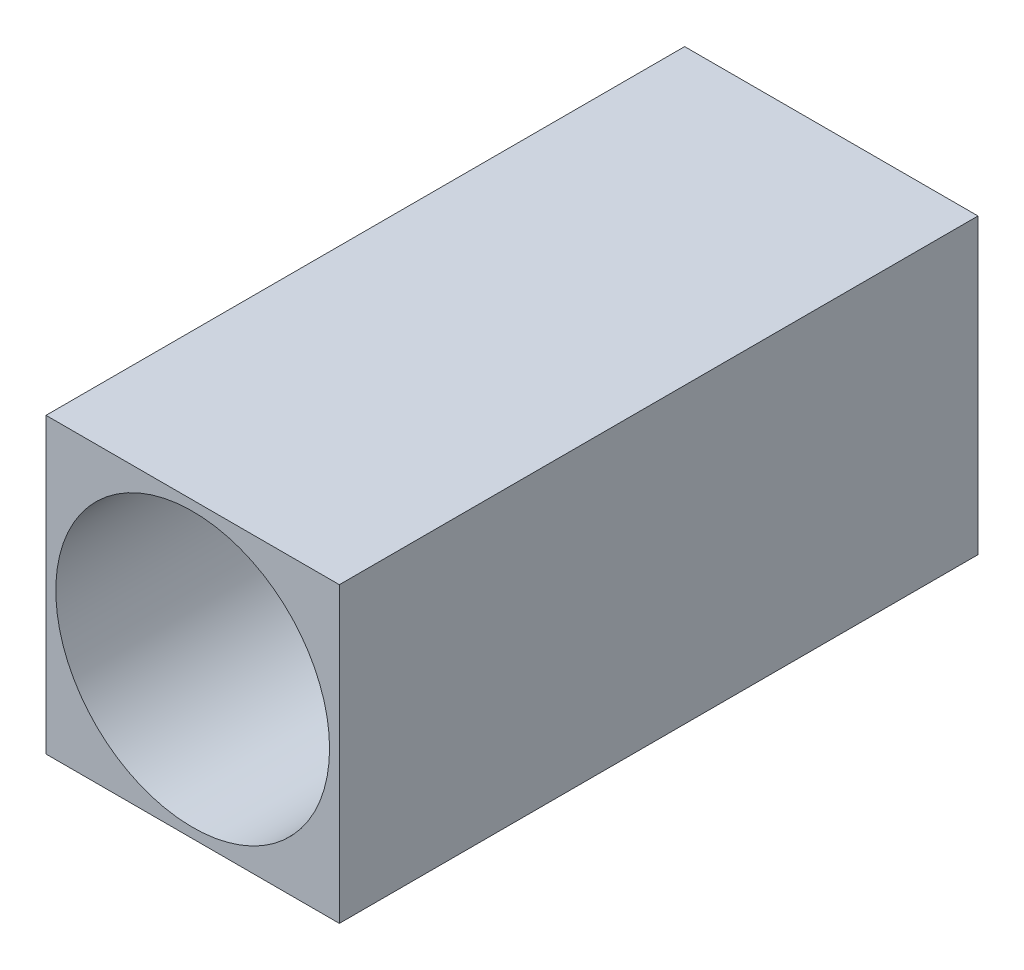
ISO-10303-21;
HEADER;
FILE_DESCRIPTION(('STEP AP214'),'2;1');
FILE_NAME('part.step','',(''),(''),'','','');
FILE_SCHEMA(('AUTOMOTIVE_DESIGN { 1 0 10303 214 1 1 1 1 }'));
ENDSEC;
DATA;
#1=APPLICATION_CONTEXT('core data for automotive mechanical design processes');
#2=APPLICATION_PROTOCOL_DEFINITION('international standard','automotive_design',2000,#1);
#3=PRODUCT_CONTEXT('',#1,'mechanical');
#4=PRODUCT('Part','Part','',(#3));
#5=PRODUCT_RELATED_PRODUCT_CATEGORY('part','',(#4));
#6=PRODUCT_DEFINITION_FORMATION('','',#4);
#7=PRODUCT_DEFINITION_CONTEXT('part definition',#1,'design');
#8=PRODUCT_DEFINITION('design','',#6,#7);
#9=PRODUCT_DEFINITION_SHAPE('','',#8);
#10=(LENGTH_UNIT() NAMED_UNIT(*) SI_UNIT(.MILLI.,.METRE.));
#11=(NAMED_UNIT(*) PLANE_ANGLE_UNIT() SI_UNIT($,.RADIAN.));
#12=(NAMED_UNIT(*) SI_UNIT($,.STERADIAN.) SOLID_ANGLE_UNIT());
#13=UNCERTAINTY_MEASURE_WITH_UNIT(LENGTH_MEASURE(1.E-05),#10,'distance_accuracy_value','');
#14=(GEOMETRIC_REPRESENTATION_CONTEXT(3) GLOBAL_UNCERTAINTY_ASSIGNED_CONTEXT((#13)) GLOBAL_UNIT_ASSIGNED_CONTEXT((#10,
#11,#12)) REPRESENTATION_CONTEXT('',''));
#15=CARTESIAN_POINT('',(0.,0.,0.));
#16=DIRECTION('',(0.,0.,1.));
#17=DIRECTION('',(1.,0.,0.));
#18=AXIS2_PLACEMENT_3D('',#15,#16,#17);
#19=CARTESIAN_POINT('',(0.,0.,-3000.));
#20=DIRECTION('',(-1.,0.,0.));
#21=DIRECTION('',(0.,0.,1.));
#22=AXIS2_PLACEMENT_3D('',#19,#20,#21);
#23=PLANE('',#22);
#24=DIRECTION('',(0.,-1.,0.));
#25=VECTOR('',#24,1.);
#26=CARTESIAN_POINT('',(0.,0.,0.));
#27=LINE('',#26,#25);
#28=CARTESIAN_POINT('',(0.,1378.,0.));
#29=VERTEX_POINT('',#28);
#30=CARTESIAN_POINT('',(0.,0.,0.));
#31=VERTEX_POINT('',#30);
#32=EDGE_CURVE('E67',#29,#31,#27,.T.);
#33=ORIENTED_EDGE('',*,*,#32,.F.);
#34=DIRECTION('',(0.,0.,1.));
#35=VECTOR('',#34,1.);
#36=CARTESIAN_POINT('',(0.,1378.,-3000.));
#37=LINE('',#36,#35);
#38=CARTESIAN_POINT('',(0.,1378.,-3000.));
#39=VERTEX_POINT('',#38);
#40=EDGE_CURVE('E11',#39,#29,#37,.T.);
#41=ORIENTED_EDGE('',*,*,#40,.F.);
#42=DIRECTION('',(0.,-1.,0.));
#43=VECTOR('',#42,1.);
#44=CARTESIAN_POINT('',(0.,0.,-3000.));
#45=LINE('',#44,#43);
#46=CARTESIAN_POINT('',(0.,0.,-3000.));
#47=VERTEX_POINT('',#46);
#48=EDGE_CURVE('E69',#39,#47,#45,.T.);
#49=ORIENTED_EDGE('',*,*,#48,.T.);
#50=DIRECTION('',(0.,0.,1.));
#51=VECTOR('',#50,1.);
#52=CARTESIAN_POINT('',(0.,0.,-3000.));
#53=LINE('',#52,#51);
#54=EDGE_CURVE('E30',#47,#31,#53,.T.);
#55=ORIENTED_EDGE('',*,*,#54,.T.);
#56=EDGE_LOOP('',(#33,#41,#49,#55));
#57=FACE_BOUND('',#56,.T.);
#58=ADVANCED_FACE('F27',(#57),#23,.T.);
#59=CARTESIAN_POINT('',(0.,1378.,-3000.));
#60=DIRECTION('',(0.,1.,0.));
#61=DIRECTION('',(0.,0.,1.));
#62=AXIS2_PLACEMENT_3D('',#59,#60,#61);
#63=PLANE('',#62);
#64=DIRECTION('',(-1.,0.,0.));
#65=VECTOR('',#64,1.);
#66=CARTESIAN_POINT('',(0.,1378.,0.));
#67=LINE('',#66,#65);
#68=CARTESIAN_POINT('',(1378.,1378.,0.));
#69=VERTEX_POINT('',#68);
#70=EDGE_CURVE('E84',#69,#29,#67,.T.);
#71=ORIENTED_EDGE('',*,*,#70,.F.);
#72=DIRECTION('',(0.,0.,1.));
#73=VECTOR('',#72,1.);
#74=CARTESIAN_POINT('',(1378.,1378.,-3000.));
#75=LINE('',#74,#73);
#76=CARTESIAN_POINT('',(1378.,1378.,-3000.));
#77=VERTEX_POINT('',#76);
#78=EDGE_CURVE('E35',#77,#69,#75,.T.);
#79=ORIENTED_EDGE('',*,*,#78,.F.);
#80=DIRECTION('',(-1.,0.,0.));
#81=VECTOR('',#80,1.);
#82=CARTESIAN_POINT('',(0.,1378.,-3000.));
#83=LINE('',#82,#81);
#84=EDGE_CURVE('E74',#77,#39,#83,.T.);
#85=ORIENTED_EDGE('',*,*,#84,.T.);
#86=ORIENTED_EDGE('',*,*,#40,.T.);
#87=EDGE_LOOP('',(#71,#79,#85,#86));
#88=FACE_BOUND('',#87,.T.);
#89=ADVANCED_FACE('F104',(#88),#63,.T.);
#90=CARTESIAN_POINT('',(1378.,0.,-3000.));
#91=DIRECTION('',(1.,0.,0.));
#92=DIRECTION('',(0.,0.,-1.));
#93=AXIS2_PLACEMENT_3D('',#90,#91,#92);
#94=PLANE('',#93);
#95=DIRECTION('',(0.,1.,0.));
#96=VECTOR('',#95,1.);
#97=CARTESIAN_POINT('',(1378.,0.,0.));
#98=LINE('',#97,#96);
#99=CARTESIAN_POINT('',(1378.,0.,0.));
#100=VERTEX_POINT('',#99);
#101=EDGE_CURVE('E81',#100,#69,#98,.T.);
#102=ORIENTED_EDGE('',*,*,#101,.F.);
#103=DIRECTION('',(0.,0.,1.));
#104=VECTOR('',#103,1.);
#105=CARTESIAN_POINT('',(1378.,0.,-3000.));
#106=LINE('',#105,#104);
#107=CARTESIAN_POINT('',(1378.,0.,-3000.));
#108=VERTEX_POINT('',#107);
#109=EDGE_CURVE('E73',#108,#100,#106,.T.);
#110=ORIENTED_EDGE('',*,*,#109,.F.);
#111=DIRECTION('',(0.,1.,0.));
#112=VECTOR('',#111,1.);
#113=CARTESIAN_POINT('',(1378.,0.,-3000.));
#114=LINE('',#113,#112);
#115=EDGE_CURVE('E97',#108,#77,#114,.T.);
#116=ORIENTED_EDGE('',*,*,#115,.T.);
#117=ORIENTED_EDGE('',*,*,#78,.T.);
#118=EDGE_LOOP('',(#102,#110,#116,#117));
#119=FACE_BOUND('',#118,.T.);
#120=ADVANCED_FACE('F101',(#119),#94,.T.);
#121=CARTESIAN_POINT('',(0.,0.,-3000.));
#122=DIRECTION('',(0.,-1.,0.));
#123=DIRECTION('',(0.,0.,-1.));
#124=AXIS2_PLACEMENT_3D('',#121,#122,#123);
#125=PLANE('',#124);
#126=DIRECTION('',(1.,0.,0.));
#127=VECTOR('',#126,1.);
#128=CARTESIAN_POINT('',(0.,0.,0.));
#129=LINE('',#128,#127);
#130=EDGE_CURVE('E76',#31,#100,#129,.T.);
#131=ORIENTED_EDGE('',*,*,#130,.F.);
#132=ORIENTED_EDGE('',*,*,#54,.F.);
#133=DIRECTION('',(1.,0.,0.));
#134=VECTOR('',#133,1.);
#135=CARTESIAN_POINT('',(0.,0.,-3000.));
#136=LINE('',#135,#134);
#137=EDGE_CURVE('E95',#47,#108,#136,.T.);
#138=ORIENTED_EDGE('',*,*,#137,.T.);
#139=ORIENTED_EDGE('',*,*,#109,.T.);
#140=EDGE_LOOP('',(#131,#132,#138,#139));
#141=FACE_BOUND('',#140,.T.);
#142=ADVANCED_FACE('F77',(#141),#125,.T.);
#143=CARTESIAN_POINT('',(0.,1378.,-3000.));
#144=DIRECTION('',(0.,0.,-1.));
#145=DIRECTION('',(-1.,0.,0.));
#146=AXIS2_PLACEMENT_3D('',#143,#144,#145);
#147=PLANE('',#146);
#148=CARTESIAN_POINT('',(689.,689.,-3000.));
#149=DIRECTION('',(0.,0.,1.));
#150=DIRECTION('',(1.,0.,0.));
#151=AXIS2_PLACEMENT_3D('',#148,#149,#150);
#152=CIRCLE('',#151,643.);
#153=CARTESIAN_POINT('',(1332.,689.,-3000.));
#154=VERTEX_POINT('',#153);
#155=EDGE_CURVE('E85',#154,#154,#152,.T.);
#156=ORIENTED_EDGE('',*,*,#155,.T.);
#157=EDGE_LOOP('',(#156));
#158=FACE_BOUND('',#157,.T.);
#159=ORIENTED_EDGE('',*,*,#48,.F.);
#160=ORIENTED_EDGE('',*,*,#84,.F.);
#161=ORIENTED_EDGE('',*,*,#115,.F.);
#162=ORIENTED_EDGE('',*,*,#137,.F.);
#163=EDGE_LOOP('',(#159,#160,#161,#162));
#164=FACE_BOUND('',#163,.T.);
#165=ADVANCED_FACE('F106',(#158,#164),#147,.T.);
#166=CARTESIAN_POINT('',(0.,1378.,0.));
#167=DIRECTION('',(0.,0.,-1.));
#168=DIRECTION('',(-1.,0.,0.));
#169=AXIS2_PLACEMENT_3D('',#166,#167,#168);
#170=PLANE('',#169);
#171=CARTESIAN_POINT('',(689.,689.,0.));
#172=DIRECTION('',(0.,0.,1.));
#173=DIRECTION('',(1.,0.,0.));
#174=AXIS2_PLACEMENT_3D('',#171,#172,#173);
#175=CIRCLE('',#174,643.);
#176=CARTESIAN_POINT('',(1332.,689.,0.));
#177=VERTEX_POINT('',#176);
#178=EDGE_CURVE('E88',#177,#177,#175,.T.);
#179=ORIENTED_EDGE('',*,*,#178,.F.);
#180=EDGE_LOOP('',(#179));
#181=FACE_BOUND('',#180,.T.);
#182=ORIENTED_EDGE('',*,*,#32,.T.);
#183=ORIENTED_EDGE('',*,*,#130,.T.);
#184=ORIENTED_EDGE('',*,*,#101,.T.);
#185=ORIENTED_EDGE('',*,*,#70,.T.);
#186=EDGE_LOOP('',(#182,#183,#184,#185));
#187=FACE_BOUND('',#186,.T.);
#188=ADVANCED_FACE('F83',(#181,#187),#170,.F.);
#189=CARTESIAN_POINT('',(689.,689.,-3000.));
#190=DIRECTION('',(0.,0.,1.));
#191=DIRECTION('',(1.,0.,0.));
#192=AXIS2_PLACEMENT_3D('',#189,#190,#191);
#193=CYLINDRICAL_SURFACE('',#192,643.);
#194=ORIENTED_EDGE('',*,*,#155,.F.);
#195=EDGE_LOOP('',(#194));
#196=FACE_BOUND('',#195,.T.);
#197=ORIENTED_EDGE('',*,*,#178,.T.);
#198=EDGE_LOOP('',(#197));
#199=FACE_BOUND('',#198,.T.);
#200=ADVANCED_FACE('F114',(#196,#199),#193,.F.);
#201=CLOSED_SHELL('',(#58,#89,#120,#142,#165,#188,#200));
#202=MANIFOLD_SOLID_BREP('B2',#201);
#203=ADVANCED_BREP_SHAPE_REPRESENTATION('',(#18,#202),#14);
#204=SHAPE_DEFINITION_REPRESENTATION(#9,#203);
ENDSEC;
END-ISO-10303-21;
